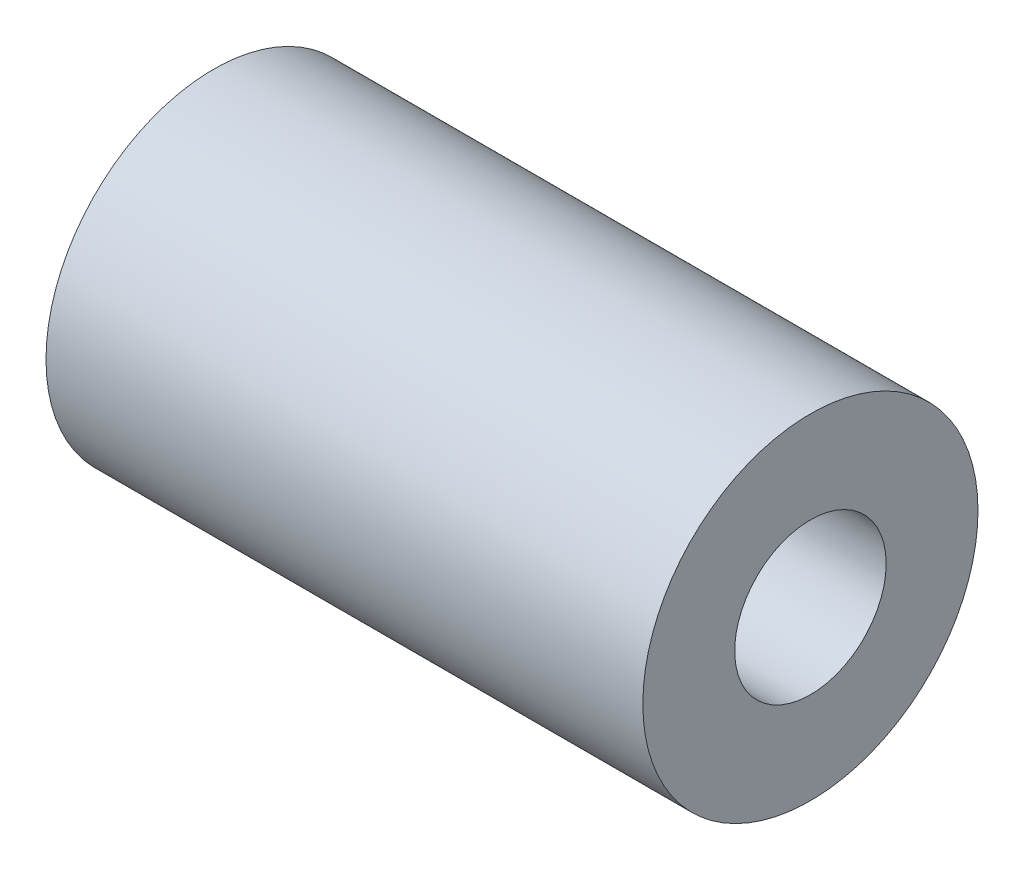
ISO-10303-21;
HEADER;
FILE_DESCRIPTION(('STEP AP214'),'2;1');
FILE_NAME('part.step','',(''),(''),'','','');
FILE_SCHEMA(('AUTOMOTIVE_DESIGN { 1 0 10303 214 1 1 1 1 }'));
ENDSEC;
DATA;
#1=APPLICATION_CONTEXT('core data for automotive mechanical design processes');
#2=APPLICATION_PROTOCOL_DEFINITION('international standard','automotive_design',2000,#1);
#3=PRODUCT_CONTEXT('',#1,'mechanical');
#4=PRODUCT('Part','Part','',(#3));
#5=PRODUCT_RELATED_PRODUCT_CATEGORY('part','',(#4));
#6=PRODUCT_DEFINITION_FORMATION('','',#4);
#7=PRODUCT_DEFINITION_CONTEXT('part definition',#1,'design');
#8=PRODUCT_DEFINITION('design','',#6,#7);
#9=PRODUCT_DEFINITION_SHAPE('','',#8);
#10=(LENGTH_UNIT() NAMED_UNIT(*) SI_UNIT(.MILLI.,.METRE.));
#11=(NAMED_UNIT(*) PLANE_ANGLE_UNIT() SI_UNIT($,.RADIAN.));
#12=(NAMED_UNIT(*) SI_UNIT($,.STERADIAN.) SOLID_ANGLE_UNIT());
#13=UNCERTAINTY_MEASURE_WITH_UNIT(LENGTH_MEASURE(1.E-05),#10,'distance_accuracy_value','');
#14=(GEOMETRIC_REPRESENTATION_CONTEXT(3) GLOBAL_UNCERTAINTY_ASSIGNED_CONTEXT((#13)) GLOBAL_UNIT_ASSIGNED_CONTEXT((#10,
#11,#12)) REPRESENTATION_CONTEXT('',''));
#15=CARTESIAN_POINT('',(0.,0.,0.));
#16=DIRECTION('',(0.,0.,1.));
#17=DIRECTION('',(1.,0.,0.));
#18=AXIS2_PLACEMENT_3D('',#15,#16,#17);
#19=CARTESIAN_POINT('',(13.,0.,0.));
#20=DIRECTION('',(1.,0.,0.));
#21=DIRECTION('',(0.,0.,-1.));
#22=AXIS2_PLACEMENT_3D('',#19,#20,#21);
#23=PLANE('',#22);
#24=CARTESIAN_POINT('',(13.,0.,0.));
#25=DIRECTION('',(1.,0.,0.));
#26=DIRECTION('',(0.,0.,-1.));
#27=AXIS2_PLACEMENT_3D('',#24,#25,#26);
#28=CIRCLE('',#27,3.65);
#29=CARTESIAN_POINT('',(13.,0.,-3.65));
#30=VERTEX_POINT('',#29);
#31=EDGE_CURVE('E10',#30,#30,#28,.T.);
#32=ORIENTED_EDGE('',*,*,#31,.T.);
#33=EDGE_LOOP('',(#32));
#34=FACE_BOUND('',#33,.T.);
#35=CARTESIAN_POINT('',(13.,0.,0.));
#36=DIRECTION('',(1.,0.,0.));
#37=DIRECTION('',(0.,0.,-1.));
#38=AXIS2_PLACEMENT_3D('',#35,#36,#37);
#39=CIRCLE('',#38,1.65);
#40=CARTESIAN_POINT('',(13.,0.,-1.65));
#41=VERTEX_POINT('',#40);
#42=EDGE_CURVE('E44',#41,#41,#39,.T.);
#43=ORIENTED_EDGE('',*,*,#42,.F.);
#44=EDGE_LOOP('',(#43));
#45=FACE_BOUND('',#44,.T.);
#46=ADVANCED_FACE('F33',(#34,#45),#23,.T.);
#47=CARTESIAN_POINT('',(0.,0.,0.));
#48=DIRECTION('',(1.,0.,0.));
#49=DIRECTION('',(0.,0.,-1.));
#50=AXIS2_PLACEMENT_3D('',#47,#48,#49);
#51=PLANE('',#50);
#52=CARTESIAN_POINT('',(0.,0.,0.));
#53=DIRECTION('',(1.,0.,0.));
#54=DIRECTION('',(0.,0.,-1.));
#55=AXIS2_PLACEMENT_3D('',#52,#53,#54);
#56=CIRCLE('',#55,3.65);
#57=CARTESIAN_POINT('',(0.,0.,-3.65));
#58=VERTEX_POINT('',#57);
#59=EDGE_CURVE('E37',#58,#58,#56,.T.);
#60=ORIENTED_EDGE('',*,*,#59,.F.);
#61=EDGE_LOOP('',(#60));
#62=FACE_BOUND('',#61,.T.);
#63=CARTESIAN_POINT('',(0.,0.,0.));
#64=DIRECTION('',(1.,0.,0.));
#65=DIRECTION('',(0.,0.,-1.));
#66=AXIS2_PLACEMENT_3D('',#63,#64,#65);
#67=CIRCLE('',#66,1.65);
#68=CARTESIAN_POINT('',(0.,0.,-1.65));
#69=VERTEX_POINT('',#68);
#70=EDGE_CURVE('E46',#69,#69,#67,.T.);
#71=ORIENTED_EDGE('',*,*,#70,.T.);
#72=EDGE_LOOP('',(#71));
#73=FACE_BOUND('',#72,.T.);
#74=ADVANCED_FACE('F56',(#62,#73),#51,.F.);
#75=CARTESIAN_POINT('',(13.,0.,0.));
#76=DIRECTION('',(-1.,0.,0.));
#77=DIRECTION('',(0.,0.,1.));
#78=AXIS2_PLACEMENT_3D('',#75,#76,#77);
#79=CYLINDRICAL_SURFACE('',#78,3.65);
#80=ORIENTED_EDGE('',*,*,#31,.F.);
#81=EDGE_LOOP('',(#80));
#82=FACE_BOUND('',#81,.T.);
#83=ORIENTED_EDGE('',*,*,#59,.T.);
#84=EDGE_LOOP('',(#83));
#85=FACE_BOUND('',#84,.T.);
#86=ADVANCED_FACE('F35',(#82,#85),#79,.T.);
#87=CARTESIAN_POINT('',(13.,0.,0.));
#88=DIRECTION('',(-1.,0.,0.));
#89=DIRECTION('',(0.,0.,1.));
#90=AXIS2_PLACEMENT_3D('',#87,#88,#89);
#91=CYLINDRICAL_SURFACE('',#90,1.65);
#92=ORIENTED_EDGE('',*,*,#42,.T.);
#93=EDGE_LOOP('',(#92));
#94=FACE_BOUND('',#93,.T.);
#95=ORIENTED_EDGE('',*,*,#70,.F.);
#96=EDGE_LOOP('',(#95));
#97=FACE_BOUND('',#96,.T.);
#98=ADVANCED_FACE('F52',(#94,#97),#91,.F.);
#99=CLOSED_SHELL('',(#46,#74,#86,#98));
#100=MANIFOLD_SOLID_BREP('B2',#99);
#101=ADVANCED_BREP_SHAPE_REPRESENTATION('',(#18,#100),#14);
#102=SHAPE_DEFINITION_REPRESENTATION(#9,#101);
ENDSEC;
END-ISO-10303-21;
